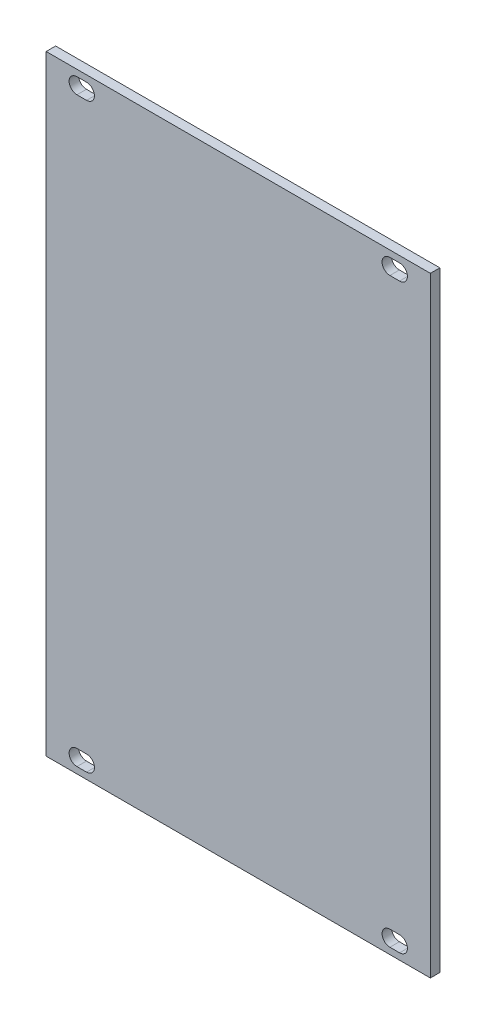
ISO-10303-21;
HEADER;
FILE_DESCRIPTION(('STEP AP214'),'2;1');
FILE_NAME('part.step','',(''),(''),'','','');
FILE_SCHEMA(('AUTOMOTIVE_DESIGN { 1 0 10303 214 1 1 1 1 }'));
ENDSEC;
DATA;
#1=APPLICATION_CONTEXT('core data for automotive mechanical design processes');
#2=APPLICATION_PROTOCOL_DEFINITION('international standard','automotive_design',2000,#1);
#3=PRODUCT_CONTEXT('',#1,'mechanical');
#4=PRODUCT('Part','Part','',(#3));
#5=PRODUCT_RELATED_PRODUCT_CATEGORY('part','',(#4));
#6=PRODUCT_DEFINITION_FORMATION('','',#4);
#7=PRODUCT_DEFINITION_CONTEXT('part definition',#1,'design');
#8=PRODUCT_DEFINITION('design','',#6,#7);
#9=PRODUCT_DEFINITION_SHAPE('','',#8);
#10=(LENGTH_UNIT() NAMED_UNIT(*) SI_UNIT(.MILLI.,.METRE.));
#11=(NAMED_UNIT(*) PLANE_ANGLE_UNIT() SI_UNIT($,.RADIAN.));
#12=(NAMED_UNIT(*) SI_UNIT($,.STERADIAN.) SOLID_ANGLE_UNIT());
#13=UNCERTAINTY_MEASURE_WITH_UNIT(LENGTH_MEASURE(1.E-05),#10,'distance_accuracy_value','');
#14=(GEOMETRIC_REPRESENTATION_CONTEXT(3) GLOBAL_UNCERTAINTY_ASSIGNED_CONTEXT((#13)) GLOBAL_UNIT_ASSIGNED_CONTEXT((#10,
#11,#12)) REPRESENTATION_CONTEXT('',''));
#15=CARTESIAN_POINT('',(0.,0.,0.));
#16=DIRECTION('',(0.,0.,1.));
#17=DIRECTION('',(1.,0.,0.));
#18=AXIS2_PLACEMENT_3D('',#15,#16,#17);
#19=CARTESIAN_POINT('',(0.,0.,2.));
#20=DIRECTION('',(0.,0.,1.));
#21=DIRECTION('',(1.,0.,0.));
#22=AXIS2_PLACEMENT_3D('',#19,#20,#21);
#23=PLANE('',#22);
#24=DIRECTION('',(0.,1.,0.));
#25=VECTOR('',#24,1.);
#26=CARTESIAN_POINT('',(40.45,64.25,2.));
#27=LINE('',#26,#25);
#28=CARTESIAN_POINT('',(40.45,-64.25,2.));
#29=VERTEX_POINT('',#28);
#30=CARTESIAN_POINT('',(40.45,64.25,2.));
#31=VERTEX_POINT('',#30);
#32=EDGE_CURVE('E360',#29,#31,#27,.T.);
#33=ORIENTED_EDGE('',*,*,#32,.T.);
#34=DIRECTION('',(-1.,0.,0.));
#35=VECTOR('',#34,1.);
#36=CARTESIAN_POINT('',(-40.45,64.25,2.));
#37=LINE('',#36,#35);
#38=CARTESIAN_POINT('',(-40.45,64.25,2.));
#39=VERTEX_POINT('',#38);
#40=EDGE_CURVE('E364',#31,#39,#37,.T.);
#41=ORIENTED_EDGE('',*,*,#40,.T.);
#42=DIRECTION('',(0.,-1.,0.));
#43=VECTOR('',#42,1.);
#44=CARTESIAN_POINT('',(-40.45,64.25,2.));
#45=LINE('',#44,#43);
#46=CARTESIAN_POINT('',(-40.45,-64.25,2.));
#47=VERTEX_POINT('',#46);
#48=EDGE_CURVE('E368',#39,#47,#45,.T.);
#49=ORIENTED_EDGE('',*,*,#48,.T.);
#50=DIRECTION('',(1.,0.,0.));
#51=VECTOR('',#50,1.);
#52=CARTESIAN_POINT('',(-40.45,-64.25,2.));
#53=LINE('',#52,#51);
#54=EDGE_CURVE('E371',#47,#29,#53,.T.);
#55=ORIENTED_EDGE('',*,*,#54,.T.);
#56=EDGE_LOOP('',(#33,#41,#49,#55));
#57=FACE_BOUND('',#56,.T.);
#58=DIRECTION('',(1.,0.,0.));
#59=VECTOR('',#58,1.);
#60=CARTESIAN_POINT('',(-33.966,-62.9,2.));
#61=LINE('',#60,#59);
#62=CARTESIAN_POINT('',(-33.966,-62.9,2.));
#63=VERTEX_POINT('',#62);
#64=CARTESIAN_POINT('',(-31.934,-62.9,2.));
#65=VERTEX_POINT('',#64);
#66=EDGE_CURVE('E320',#63,#65,#61,.T.);
#67=ORIENTED_EDGE('',*,*,#66,.F.);
#68=CARTESIAN_POINT('',(-33.966,-61.25,2.));
#69=DIRECTION('',(0.,0.,1.));
#70=DIRECTION('',(1.,0.,0.));
#71=AXIS2_PLACEMENT_3D('',#68,#69,#70);
#72=CIRCLE('',#71,1.65);
#73=CARTESIAN_POINT('',(-33.966,-59.6,2.));
#74=VERTEX_POINT('',#73);
#75=EDGE_CURVE('E317',#74,#63,#72,.T.);
#76=ORIENTED_EDGE('',*,*,#75,.F.);
#77=DIRECTION('',(-1.,0.,0.));
#78=VECTOR('',#77,1.);
#79=CARTESIAN_POINT('',(-33.966,-59.6,2.));
#80=LINE('',#79,#78);
#81=CARTESIAN_POINT('',(-31.934,-59.6,2.));
#82=VERTEX_POINT('',#81);
#83=EDGE_CURVE('E328',#82,#74,#80,.T.);
#84=ORIENTED_EDGE('',*,*,#83,.F.);
#85=CARTESIAN_POINT('',(-31.934,-61.25,2.));
#86=DIRECTION('',(0.,0.,1.));
#87=DIRECTION('',(1.,0.,0.));
#88=AXIS2_PLACEMENT_3D('',#85,#86,#87);
#89=CIRCLE('',#88,1.64999999999999);
#90=EDGE_CURVE('E324',#65,#82,#89,.T.);
#91=ORIENTED_EDGE('',*,*,#90,.F.);
#92=EDGE_LOOP('',(#67,#76,#84,#91));
#93=FACE_BOUND('',#92,.T.);
#94=DIRECTION('',(1.,0.,0.));
#95=VECTOR('',#94,1.);
#96=CARTESIAN_POINT('',(31.934000014,59.6,2.));
#97=LINE('',#96,#95);
#98=CARTESIAN_POINT('',(31.934000014,59.6,2.));
#99=VERTEX_POINT('',#98);
#100=CARTESIAN_POINT('',(33.966000014,59.6,2.));
#101=VERTEX_POINT('',#100);
#102=EDGE_CURVE('E277',#99,#101,#97,.T.);
#103=ORIENTED_EDGE('',*,*,#102,.F.);
#104=CARTESIAN_POINT('',(31.934000014,61.25,2.));
#105=DIRECTION('',(0.,0.,1.));
#106=DIRECTION('',(1.,0.,0.));
#107=AXIS2_PLACEMENT_3D('',#104,#105,#106);
#108=CIRCLE('',#107,1.65);
#109=CARTESIAN_POINT('',(31.934000014,62.9,2.));
#110=VERTEX_POINT('',#109);
#111=EDGE_CURVE('E274',#110,#99,#108,.T.);
#112=ORIENTED_EDGE('',*,*,#111,.F.);
#113=DIRECTION('',(-1.,0.,0.));
#114=VECTOR('',#113,1.);
#115=CARTESIAN_POINT('',(31.934000014,62.9,2.));
#116=LINE('',#115,#114);
#117=CARTESIAN_POINT('',(33.966000014,62.9,2.));
#118=VERTEX_POINT('',#117);
#119=EDGE_CURVE('E285',#118,#110,#116,.T.);
#120=ORIENTED_EDGE('',*,*,#119,.F.);
#121=CARTESIAN_POINT('',(33.966000014,61.25,2.));
#122=DIRECTION('',(0.,0.,1.));
#123=DIRECTION('',(1.,0.,0.));
#124=AXIS2_PLACEMENT_3D('',#121,#122,#123);
#125=CIRCLE('',#124,1.65);
#126=EDGE_CURVE('E281',#101,#118,#125,.T.);
#127=ORIENTED_EDGE('',*,*,#126,.F.);
#128=EDGE_LOOP('',(#103,#112,#120,#127));
#129=FACE_BOUND('',#128,.T.);
#130=DIRECTION('',(1.,0.,0.));
#131=VECTOR('',#130,1.);
#132=CARTESIAN_POINT('',(-33.966,59.6,2.));
#133=LINE('',#132,#131);
#134=CARTESIAN_POINT('',(-33.966,59.6,2.));
#135=VERTEX_POINT('',#134);
#136=CARTESIAN_POINT('',(-31.934,59.6,2.));
#137=VERTEX_POINT('',#136);
#138=EDGE_CURVE('E234',#135,#137,#133,.T.);
#139=ORIENTED_EDGE('',*,*,#138,.F.);
#140=CARTESIAN_POINT('',(-33.966,61.25,2.));
#141=DIRECTION('',(0.,0.,1.));
#142=DIRECTION('',(1.,0.,0.));
#143=AXIS2_PLACEMENT_3D('',#140,#141,#142);
#144=CIRCLE('',#143,1.64999999999998);
#145=CARTESIAN_POINT('',(-33.966,62.9,2.));
#146=VERTEX_POINT('',#145);
#147=EDGE_CURVE('E231',#146,#135,#144,.T.);
#148=ORIENTED_EDGE('',*,*,#147,.F.);
#149=DIRECTION('',(-1.,0.,0.));
#150=VECTOR('',#149,1.);
#151=CARTESIAN_POINT('',(-33.966,62.9,2.));
#152=LINE('',#151,#150);
#153=CARTESIAN_POINT('',(-31.934,62.9,2.));
#154=VERTEX_POINT('',#153);
#155=EDGE_CURVE('E242',#154,#146,#152,.T.);
#156=ORIENTED_EDGE('',*,*,#155,.F.);
#157=CARTESIAN_POINT('',(-31.934,61.25,2.));
#158=DIRECTION('',(0.,0.,1.));
#159=DIRECTION('',(1.,0.,0.));
#160=AXIS2_PLACEMENT_3D('',#157,#158,#159);
#161=CIRCLE('',#160,1.64999999999998);
#162=EDGE_CURVE('E238',#137,#154,#161,.T.);
#163=ORIENTED_EDGE('',*,*,#162,.F.);
#164=EDGE_LOOP('',(#139,#148,#156,#163));
#165=FACE_BOUND('',#164,.T.);
#166=DIRECTION('',(1.,0.,0.));
#167=VECTOR('',#166,1.);
#168=CARTESIAN_POINT('',(31.934000014,-62.9,2.));
#169=LINE('',#168,#167);
#170=CARTESIAN_POINT('',(31.934000014,-62.9,2.));
#171=VERTEX_POINT('',#170);
#172=CARTESIAN_POINT('',(33.966000014,-62.9,2.));
#173=VERTEX_POINT('',#172);
#174=EDGE_CURVE('E192',#171,#173,#169,.T.);
#175=ORIENTED_EDGE('',*,*,#174,.F.);
#176=CARTESIAN_POINT('',(31.934000014,-61.25,2.));
#177=DIRECTION('',(0.,0.,1.));
#178=DIRECTION('',(1.,0.,0.));
#179=AXIS2_PLACEMENT_3D('',#176,#177,#178);
#180=CIRCLE('',#179,1.65);
#181=CARTESIAN_POINT('',(31.934000014,-59.6,2.));
#182=VERTEX_POINT('',#181);
#183=EDGE_CURVE('E183',#182,#171,#180,.T.);
#184=ORIENTED_EDGE('',*,*,#183,.F.);
#185=DIRECTION('',(-1.,0.,0.));
#186=VECTOR('',#185,1.);
#187=CARTESIAN_POINT('',(31.934000014,-59.6,2.));
#188=LINE('',#187,#186);
#189=CARTESIAN_POINT('',(33.966000014,-59.6,2.));
#190=VERTEX_POINT('',#189);
#191=EDGE_CURVE('E209',#190,#182,#188,.T.);
#192=ORIENTED_EDGE('',*,*,#191,.F.);
#193=CARTESIAN_POINT('',(33.966000014,-61.25,2.));
#194=DIRECTION('',(0.,0.,1.));
#195=DIRECTION('',(1.,0.,0.));
#196=AXIS2_PLACEMENT_3D('',#193,#194,#195);
#197=CIRCLE('',#196,1.65);
#198=EDGE_CURVE('E205',#173,#190,#197,.T.);
#199=ORIENTED_EDGE('',*,*,#198,.F.);
#200=EDGE_LOOP('',(#175,#184,#192,#199));
#201=FACE_BOUND('',#200,.T.);
#202=ADVANCED_FACE('F45',(#57,#93,#129,#165,#201),#23,.T.);
#203=CARTESIAN_POINT('',(0.,0.,0.));
#204=DIRECTION('',(0.,0.,1.));
#205=DIRECTION('',(1.,0.,0.));
#206=AXIS2_PLACEMENT_3D('',#203,#204,#205);
#207=PLANE('',#206);
#208=CARTESIAN_POINT('',(-33.966,61.25,0.));
#209=DIRECTION('',(0.,0.,1.));
#210=DIRECTION('',(1.,0.,0.));
#211=AXIS2_PLACEMENT_3D('',#208,#209,#210);
#212=CIRCLE('',#211,1.64999999999998);
#213=CARTESIAN_POINT('',(-33.966,62.9,0.));
#214=VERTEX_POINT('',#213);
#215=CARTESIAN_POINT('',(-33.966,59.6,0.));
#216=VERTEX_POINT('',#215);
#217=EDGE_CURVE('E201',#214,#216,#212,.T.);
#218=ORIENTED_EDGE('',*,*,#217,.T.);
#219=DIRECTION('',(1.,0.,0.));
#220=VECTOR('',#219,1.);
#221=CARTESIAN_POINT('',(-33.966,59.6,0.));
#222=LINE('',#221,#220);
#223=CARTESIAN_POINT('',(-31.934,59.6,0.));
#224=VERTEX_POINT('',#223);
#225=EDGE_CURVE('E249',#216,#224,#222,.T.);
#226=ORIENTED_EDGE('',*,*,#225,.T.);
#227=CARTESIAN_POINT('',(-31.934,61.25,0.));
#228=DIRECTION('',(0.,0.,1.));
#229=DIRECTION('',(1.,0.,0.));
#230=AXIS2_PLACEMENT_3D('',#227,#228,#229);
#231=CIRCLE('',#230,1.64999999999998);
#232=CARTESIAN_POINT('',(-31.934,62.9,0.));
#233=VERTEX_POINT('',#232);
#234=EDGE_CURVE('E253',#224,#233,#231,.T.);
#235=ORIENTED_EDGE('',*,*,#234,.T.);
#236=DIRECTION('',(-1.,0.,0.));
#237=VECTOR('',#236,1.);
#238=CARTESIAN_POINT('',(-33.966,62.9,0.));
#239=LINE('',#238,#237);
#240=EDGE_CURVE('E235',#233,#214,#239,.T.);
#241=ORIENTED_EDGE('',*,*,#240,.T.);
#242=EDGE_LOOP('',(#218,#226,#235,#241));
#243=FACE_BOUND('',#242,.T.);
#244=CARTESIAN_POINT('',(-33.966,-61.25,0.));
#245=DIRECTION('',(0.,0.,1.));
#246=DIRECTION('',(1.,0.,0.));
#247=AXIS2_PLACEMENT_3D('',#244,#245,#246);
#248=CIRCLE('',#247,1.65);
#249=CARTESIAN_POINT('',(-33.966,-59.6,0.));
#250=VERTEX_POINT('',#249);
#251=CARTESIAN_POINT('',(-33.966,-62.9,0.));
#252=VERTEX_POINT('',#251);
#253=EDGE_CURVE('E316',#250,#252,#248,.T.);
#254=ORIENTED_EDGE('',*,*,#253,.T.);
#255=DIRECTION('',(1.,0.,0.));
#256=VECTOR('',#255,1.);
#257=CARTESIAN_POINT('',(-33.966,-62.9,0.));
#258=LINE('',#257,#256);
#259=CARTESIAN_POINT('',(-31.934,-62.9,0.));
#260=VERTEX_POINT('',#259);
#261=EDGE_CURVE('E335',#252,#260,#258,.T.);
#262=ORIENTED_EDGE('',*,*,#261,.T.);
#263=CARTESIAN_POINT('',(-31.934,-61.25,0.));
#264=DIRECTION('',(0.,0.,1.));
#265=DIRECTION('',(1.,0.,0.));
#266=AXIS2_PLACEMENT_3D('',#263,#264,#265);
#267=CIRCLE('',#266,1.64999999999999);
#268=CARTESIAN_POINT('',(-31.934,-59.6,0.));
#269=VERTEX_POINT('',#268);
#270=EDGE_CURVE('E339',#260,#269,#267,.T.);
#271=ORIENTED_EDGE('',*,*,#270,.T.);
#272=DIRECTION('',(-1.,0.,0.));
#273=VECTOR('',#272,1.);
#274=CARTESIAN_POINT('',(-33.966,-59.6,0.));
#275=LINE('',#274,#273);
#276=EDGE_CURVE('E321',#269,#250,#275,.T.);
#277=ORIENTED_EDGE('',*,*,#276,.T.);
#278=EDGE_LOOP('',(#254,#262,#271,#277));
#279=FACE_BOUND('',#278,.T.);
#280=DIRECTION('',(0.,1.,0.));
#281=VECTOR('',#280,1.);
#282=CARTESIAN_POINT('',(40.45,64.25,0.));
#283=LINE('',#282,#281);
#284=CARTESIAN_POINT('',(40.45,-64.25,0.));
#285=VERTEX_POINT('',#284);
#286=CARTESIAN_POINT('',(40.45,64.25,0.));
#287=VERTEX_POINT('',#286);
#288=EDGE_CURVE('E359',#285,#287,#283,.T.);
#289=ORIENTED_EDGE('',*,*,#288,.F.);
#290=DIRECTION('',(1.,0.,0.));
#291=VECTOR('',#290,1.);
#292=CARTESIAN_POINT('',(-40.45,-64.25,0.));
#293=LINE('',#292,#291);
#294=CARTESIAN_POINT('',(-40.45,-64.25,0.));
#295=VERTEX_POINT('',#294);
#296=EDGE_CURVE('E365',#295,#285,#293,.T.);
#297=ORIENTED_EDGE('',*,*,#296,.F.);
#298=DIRECTION('',(0.,-1.,0.));
#299=VECTOR('',#298,1.);
#300=CARTESIAN_POINT('',(-40.45,64.25,0.));
#301=LINE('',#300,#299);
#302=CARTESIAN_POINT('',(-40.45,64.25,0.));
#303=VERTEX_POINT('',#302);
#304=EDGE_CURVE('E381',#303,#295,#301,.T.);
#305=ORIENTED_EDGE('',*,*,#304,.F.);
#306=DIRECTION('',(-1.,0.,0.));
#307=VECTOR('',#306,1.);
#308=CARTESIAN_POINT('',(-40.45,64.25,0.));
#309=LINE('',#308,#307);
#310=EDGE_CURVE('E378',#287,#303,#309,.T.);
#311=ORIENTED_EDGE('',*,*,#310,.F.);
#312=EDGE_LOOP('',(#289,#297,#305,#311));
#313=FACE_BOUND('',#312,.T.);
#314=CARTESIAN_POINT('',(31.934000014,61.25,0.));
#315=DIRECTION('',(0.,0.,1.));
#316=DIRECTION('',(1.,0.,0.));
#317=AXIS2_PLACEMENT_3D('',#314,#315,#316);
#318=CIRCLE('',#317,1.65);
#319=CARTESIAN_POINT('',(31.934000014,62.9,0.));
#320=VERTEX_POINT('',#319);
#321=CARTESIAN_POINT('',(31.934000014,59.6,0.));
#322=VERTEX_POINT('',#321);
#323=EDGE_CURVE('E273',#320,#322,#318,.T.);
#324=ORIENTED_EDGE('',*,*,#323,.T.);
#325=DIRECTION('',(1.,0.,0.));
#326=VECTOR('',#325,1.);
#327=CARTESIAN_POINT('',(31.934000014,59.6,0.));
#328=LINE('',#327,#326);
#329=CARTESIAN_POINT('',(33.966000014,59.6,0.));
#330=VERTEX_POINT('',#329);
#331=EDGE_CURVE('E292',#322,#330,#328,.T.);
#332=ORIENTED_EDGE('',*,*,#331,.T.);
#333=CARTESIAN_POINT('',(33.966000014,61.25,0.));
#334=DIRECTION('',(0.,0.,1.));
#335=DIRECTION('',(1.,0.,0.));
#336=AXIS2_PLACEMENT_3D('',#333,#334,#335);
#337=CIRCLE('',#336,1.65);
#338=CARTESIAN_POINT('',(33.966000014,62.9,0.));
#339=VERTEX_POINT('',#338);
#340=EDGE_CURVE('E296',#330,#339,#337,.T.);
#341=ORIENTED_EDGE('',*,*,#340,.T.);
#342=DIRECTION('',(-1.,0.,0.));
#343=VECTOR('',#342,1.);
#344=CARTESIAN_POINT('',(31.934000014,62.9,0.));
#345=LINE('',#344,#343);
#346=EDGE_CURVE('E278',#339,#320,#345,.T.);
#347=ORIENTED_EDGE('',*,*,#346,.T.);
#348=EDGE_LOOP('',(#324,#332,#341,#347));
#349=FACE_BOUND('',#348,.T.);
#350=CARTESIAN_POINT('',(31.934000014,-61.25,0.));
#351=DIRECTION('',(0.,0.,1.));
#352=DIRECTION('',(1.,0.,0.));
#353=AXIS2_PLACEMENT_3D('',#350,#351,#352);
#354=CIRCLE('',#353,1.65);
#355=CARTESIAN_POINT('',(31.934000014,-59.6,0.));
#356=VERTEX_POINT('',#355);
#357=CARTESIAN_POINT('',(31.934000014,-62.9,0.));
#358=VERTEX_POINT('',#357);
#359=EDGE_CURVE('E69',#356,#358,#354,.T.);
#360=ORIENTED_EDGE('',*,*,#359,.T.);
#361=DIRECTION('',(1.,0.,0.));
#362=VECTOR('',#361,1.);
#363=CARTESIAN_POINT('',(31.934000014,-62.9,0.));
#364=LINE('',#363,#362);
#365=CARTESIAN_POINT('',(33.966000014,-62.9,0.));
#366=VERTEX_POINT('',#365);
#367=EDGE_CURVE('E199',#358,#366,#364,.T.);
#368=ORIENTED_EDGE('',*,*,#367,.T.);
#369=CARTESIAN_POINT('',(33.966000014,-61.25,0.));
#370=DIRECTION('',(0.,0.,1.));
#371=DIRECTION('',(1.,0.,0.));
#372=AXIS2_PLACEMENT_3D('',#369,#370,#371);
#373=CIRCLE('',#372,1.65);
#374=CARTESIAN_POINT('',(33.966000014,-59.6,0.));
#375=VERTEX_POINT('',#374);
#376=EDGE_CURVE('E218',#366,#375,#373,.T.);
#377=ORIENTED_EDGE('',*,*,#376,.T.);
#378=DIRECTION('',(-1.,0.,0.));
#379=VECTOR('',#378,1.);
#380=CARTESIAN_POINT('',(31.934000014,-59.6,0.));
#381=LINE('',#380,#379);
#382=EDGE_CURVE('E193',#375,#356,#381,.T.);
#383=ORIENTED_EDGE('',*,*,#382,.T.);
#384=EDGE_LOOP('',(#360,#368,#377,#383));
#385=FACE_BOUND('',#384,.T.);
#386=ADVANCED_FACE('F404',(#243,#279,#313,#349,#385),#207,.F.);
#387=CARTESIAN_POINT('',(40.45,64.25,2.));
#388=DIRECTION('',(-1.,0.,0.));
#389=DIRECTION('',(0.,-1.,0.));
#390=AXIS2_PLACEMENT_3D('',#387,#388,#389);
#391=PLANE('',#390);
#392=ORIENTED_EDGE('',*,*,#288,.T.);
#393=DIRECTION('',(0.,0.,-1.));
#394=VECTOR('',#393,1.);
#395=CARTESIAN_POINT('',(40.45,64.25,2.));
#396=LINE('',#395,#394);
#397=EDGE_CURVE('E11',#31,#287,#396,.T.);
#398=ORIENTED_EDGE('',*,*,#397,.F.);
#399=ORIENTED_EDGE('',*,*,#32,.F.);
#400=DIRECTION('',(0.,0.,-1.));
#401=VECTOR('',#400,1.);
#402=CARTESIAN_POINT('',(40.45,-64.25,2.));
#403=LINE('',#402,#401);
#404=EDGE_CURVE('E374',#29,#285,#403,.T.);
#405=ORIENTED_EDGE('',*,*,#404,.T.);
#406=EDGE_LOOP('',(#392,#398,#399,#405));
#407=FACE_BOUND('',#406,.T.);
#408=ADVANCED_FACE('F47',(#407),#391,.F.);
#409=CARTESIAN_POINT('',(-40.45,64.25,2.));
#410=DIRECTION('',(0.,-1.,0.));
#411=DIRECTION('',(0.,0.,-1.));
#412=AXIS2_PLACEMENT_3D('',#409,#410,#411);
#413=PLANE('',#412);
#414=ORIENTED_EDGE('',*,*,#310,.T.);
#415=DIRECTION('',(0.,0.,-1.));
#416=VECTOR('',#415,1.);
#417=CARTESIAN_POINT('',(-40.45,64.25,2.));
#418=LINE('',#417,#416);
#419=EDGE_CURVE('E54',#39,#303,#418,.T.);
#420=ORIENTED_EDGE('',*,*,#419,.F.);
#421=ORIENTED_EDGE('',*,*,#40,.F.);
#422=ORIENTED_EDGE('',*,*,#397,.T.);
#423=EDGE_LOOP('',(#414,#420,#421,#422));
#424=FACE_BOUND('',#423,.T.);
#425=ADVANCED_FACE('F415',(#424),#413,.F.);
#426=CARTESIAN_POINT('',(-40.45,64.25,2.));
#427=DIRECTION('',(1.,0.,0.));
#428=DIRECTION('',(0.,1.,0.));
#429=AXIS2_PLACEMENT_3D('',#426,#427,#428);
#430=PLANE('',#429);
#431=ORIENTED_EDGE('',*,*,#304,.T.);
#432=DIRECTION('',(0.,0.,-1.));
#433=VECTOR('',#432,1.);
#434=CARTESIAN_POINT('',(-40.45,-64.25,2.));
#435=LINE('',#434,#433);
#436=EDGE_CURVE('E389',#47,#295,#435,.T.);
#437=ORIENTED_EDGE('',*,*,#436,.F.);
#438=ORIENTED_EDGE('',*,*,#48,.F.);
#439=ORIENTED_EDGE('',*,*,#419,.T.);
#440=EDGE_LOOP('',(#431,#437,#438,#439));
#441=FACE_BOUND('',#440,.T.);
#442=ADVANCED_FACE('F398',(#441),#430,.F.);
#443=CARTESIAN_POINT('',(-40.45,-64.25,2.));
#444=DIRECTION('',(0.,1.,0.));
#445=DIRECTION('',(0.,0.,1.));
#446=AXIS2_PLACEMENT_3D('',#443,#444,#445);
#447=PLANE('',#446);
#448=ORIENTED_EDGE('',*,*,#296,.T.);
#449=ORIENTED_EDGE('',*,*,#404,.F.);
#450=ORIENTED_EDGE('',*,*,#54,.F.);
#451=ORIENTED_EDGE('',*,*,#436,.T.);
#452=EDGE_LOOP('',(#448,#449,#450,#451));
#453=FACE_BOUND('',#452,.T.);
#454=ADVANCED_FACE('F408',(#453),#447,.F.);
#455=CARTESIAN_POINT('',(-33.966,-61.25,2.));
#456=DIRECTION('',(0.,0.,-1.));
#457=DIRECTION('',(-1.,0.,0.));
#458=AXIS2_PLACEMENT_3D('',#455,#456,#457);
#459=CYLINDRICAL_SURFACE('',#458,1.65);
#460=ORIENTED_EDGE('',*,*,#253,.F.);
#461=DIRECTION('',(0.,0.,-1.));
#462=VECTOR('',#461,1.);
#463=CARTESIAN_POINT('',(-33.966,-59.6,2.));
#464=LINE('',#463,#462);
#465=EDGE_CURVE('E331',#74,#250,#464,.T.);
#466=ORIENTED_EDGE('',*,*,#465,.F.);
#467=ORIENTED_EDGE('',*,*,#75,.T.);
#468=DIRECTION('',(0.,0.,-1.));
#469=VECTOR('',#468,1.);
#470=CARTESIAN_POINT('',(-33.966,-62.9,2.));
#471=LINE('',#470,#469);
#472=EDGE_CURVE('E355',#63,#252,#471,.T.);
#473=ORIENTED_EDGE('',*,*,#472,.T.);
#474=EDGE_LOOP('',(#460,#466,#467,#473));
#475=FACE_BOUND('',#474,.T.);
#476=ADVANCED_FACE('F430',(#475),#459,.F.);
#477=CARTESIAN_POINT('',(-33.966,-62.9,2.));
#478=DIRECTION('',(0.,1.,0.));
#479=DIRECTION('',(-1.,0.,0.));
#480=AXIS2_PLACEMENT_3D('',#477,#478,#479);
#481=PLANE('',#480);
#482=ORIENTED_EDGE('',*,*,#261,.F.);
#483=ORIENTED_EDGE('',*,*,#472,.F.);
#484=ORIENTED_EDGE('',*,*,#66,.T.);
#485=DIRECTION('',(0.,0.,-1.));
#486=VECTOR('',#485,1.);
#487=CARTESIAN_POINT('',(-31.934,-62.9,2.));
#488=LINE('',#487,#486);
#489=EDGE_CURVE('E352',#65,#260,#488,.T.);
#490=ORIENTED_EDGE('',*,*,#489,.T.);
#491=EDGE_LOOP('',(#482,#483,#484,#490));
#492=FACE_BOUND('',#491,.T.);
#493=ADVANCED_FACE('F437',(#492),#481,.T.);
#494=CARTESIAN_POINT('',(-31.934,-61.25,2.));
#495=DIRECTION('',(0.,0.,-1.));
#496=DIRECTION('',(-1.,0.,0.));
#497=AXIS2_PLACEMENT_3D('',#494,#495,#496);
#498=CYLINDRICAL_SURFACE('',#497,1.64999999999999);
#499=ORIENTED_EDGE('',*,*,#270,.F.);
#500=ORIENTED_EDGE('',*,*,#489,.F.);
#501=ORIENTED_EDGE('',*,*,#90,.T.);
#502=DIRECTION('',(0.,0.,-1.));
#503=VECTOR('',#502,1.);
#504=CARTESIAN_POINT('',(-31.934,-59.6,2.));
#505=LINE('',#504,#503);
#506=EDGE_CURVE('E349',#82,#269,#505,.T.);
#507=ORIENTED_EDGE('',*,*,#506,.T.);
#508=EDGE_LOOP('',(#499,#500,#501,#507));
#509=FACE_BOUND('',#508,.T.);
#510=ADVANCED_FACE('F442',(#509),#498,.F.);
#511=CARTESIAN_POINT('',(-33.966,-59.6,2.));
#512=DIRECTION('',(0.,-1.,0.));
#513=DIRECTION('',(0.,0.,-1.));
#514=AXIS2_PLACEMENT_3D('',#511,#512,#513);
#515=PLANE('',#514);
#516=ORIENTED_EDGE('',*,*,#276,.F.);
#517=ORIENTED_EDGE('',*,*,#506,.F.);
#518=ORIENTED_EDGE('',*,*,#83,.T.);
#519=ORIENTED_EDGE('',*,*,#465,.T.);
#520=EDGE_LOOP('',(#516,#517,#518,#519));
#521=FACE_BOUND('',#520,.T.);
#522=ADVANCED_FACE('F450',(#521),#515,.T.);
#523=CARTESIAN_POINT('',(31.934000014,61.25,2.));
#524=DIRECTION('',(0.,0.,-1.));
#525=DIRECTION('',(-1.,0.,0.));
#526=AXIS2_PLACEMENT_3D('',#523,#524,#525);
#527=CYLINDRICAL_SURFACE('',#526,1.65);
#528=ORIENTED_EDGE('',*,*,#323,.F.);
#529=DIRECTION('',(0.,0.,-1.));
#530=VECTOR('',#529,1.);
#531=CARTESIAN_POINT('',(31.934000014,62.9,2.));
#532=LINE('',#531,#530);
#533=EDGE_CURVE('E288',#110,#320,#532,.T.);
#534=ORIENTED_EDGE('',*,*,#533,.F.);
#535=ORIENTED_EDGE('',*,*,#111,.T.);
#536=DIRECTION('',(0.,0.,-1.));
#537=VECTOR('',#536,1.);
#538=CARTESIAN_POINT('',(31.934000014,59.6,2.));
#539=LINE('',#538,#537);
#540=EDGE_CURVE('E312',#99,#322,#539,.T.);
#541=ORIENTED_EDGE('',*,*,#540,.T.);
#542=EDGE_LOOP('',(#528,#534,#535,#541));
#543=FACE_BOUND('',#542,.T.);
#544=ADVANCED_FACE('F504',(#543),#527,.F.);
#545=CARTESIAN_POINT('',(31.934000014,59.6,2.));
#546=DIRECTION('',(0.,1.,0.));
#547=DIRECTION('',(0.,0.,1.));
#548=AXIS2_PLACEMENT_3D('',#545,#546,#547);
#549=PLANE('',#548);
#550=ORIENTED_EDGE('',*,*,#331,.F.);
#551=ORIENTED_EDGE('',*,*,#540,.F.);
#552=ORIENTED_EDGE('',*,*,#102,.T.);
#553=DIRECTION('',(0.,0.,-1.));
#554=VECTOR('',#553,1.);
#555=CARTESIAN_POINT('',(33.966000014,59.6,2.));
#556=LINE('',#555,#554);
#557=EDGE_CURVE('E309',#101,#330,#556,.T.);
#558=ORIENTED_EDGE('',*,*,#557,.T.);
#559=EDGE_LOOP('',(#550,#551,#552,#558));
#560=FACE_BOUND('',#559,.T.);
#561=ADVANCED_FACE('F500',(#560),#549,.T.);
#562=CARTESIAN_POINT('',(33.966000014,61.25,2.));
#563=DIRECTION('',(0.,0.,-1.));
#564=DIRECTION('',(-1.,0.,0.));
#565=AXIS2_PLACEMENT_3D('',#562,#563,#564);
#566=CYLINDRICAL_SURFACE('',#565,1.65);
#567=ORIENTED_EDGE('',*,*,#340,.F.);
#568=ORIENTED_EDGE('',*,*,#557,.F.);
#569=ORIENTED_EDGE('',*,*,#126,.T.);
#570=DIRECTION('',(0.,0.,-1.));
#571=VECTOR('',#570,1.);
#572=CARTESIAN_POINT('',(33.966000014,62.9,2.));
#573=LINE('',#572,#571);
#574=EDGE_CURVE('E306',#118,#339,#573,.T.);
#575=ORIENTED_EDGE('',*,*,#574,.T.);
#576=EDGE_LOOP('',(#567,#568,#569,#575));
#577=FACE_BOUND('',#576,.T.);
#578=ADVANCED_FACE('F496',(#577),#566,.F.);
#579=CARTESIAN_POINT('',(31.934000014,62.9,2.));
#580=DIRECTION('',(0.,-1.,0.));
#581=DIRECTION('',(0.,0.,-1.));
#582=AXIS2_PLACEMENT_3D('',#579,#580,#581);
#583=PLANE('',#582);
#584=ORIENTED_EDGE('',*,*,#346,.F.);
#585=ORIENTED_EDGE('',*,*,#574,.F.);
#586=ORIENTED_EDGE('',*,*,#119,.T.);
#587=ORIENTED_EDGE('',*,*,#533,.T.);
#588=EDGE_LOOP('',(#584,#585,#586,#587));
#589=FACE_BOUND('',#588,.T.);
#590=ADVANCED_FACE('F493',(#589),#583,.T.);
#591=CARTESIAN_POINT('',(-33.966,61.25,2.));
#592=DIRECTION('',(0.,0.,-1.));
#593=DIRECTION('',(-1.,0.,0.));
#594=AXIS2_PLACEMENT_3D('',#591,#592,#593);
#595=CYLINDRICAL_SURFACE('',#594,1.64999999999998);
#596=ORIENTED_EDGE('',*,*,#217,.F.);
#597=DIRECTION('',(0.,0.,-1.));
#598=VECTOR('',#597,1.);
#599=CARTESIAN_POINT('',(-33.966,62.9,2.));
#600=LINE('',#599,#598);
#601=EDGE_CURVE('E245',#146,#214,#600,.T.);
#602=ORIENTED_EDGE('',*,*,#601,.F.);
#603=ORIENTED_EDGE('',*,*,#147,.T.);
#604=DIRECTION('',(0.,0.,-1.));
#605=VECTOR('',#604,1.);
#606=CARTESIAN_POINT('',(-33.966,59.6,2.));
#607=LINE('',#606,#605);
#608=EDGE_CURVE('E269',#135,#216,#607,.T.);
#609=ORIENTED_EDGE('',*,*,#608,.T.);
#610=EDGE_LOOP('',(#596,#602,#603,#609));
#611=FACE_BOUND('',#610,.T.);
#612=ADVANCED_FACE('F475',(#611),#595,.F.);
#613=CARTESIAN_POINT('',(-33.966,59.6,2.));
#614=DIRECTION('',(0.,1.,0.));
#615=DIRECTION('',(0.,0.,1.));
#616=AXIS2_PLACEMENT_3D('',#613,#614,#615);
#617=PLANE('',#616);
#618=ORIENTED_EDGE('',*,*,#225,.F.);
#619=ORIENTED_EDGE('',*,*,#608,.F.);
#620=ORIENTED_EDGE('',*,*,#138,.T.);
#621=DIRECTION('',(0.,0.,-1.));
#622=VECTOR('',#621,1.);
#623=CARTESIAN_POINT('',(-31.934,59.6,2.));
#624=LINE('',#623,#622);
#625=EDGE_CURVE('E266',#137,#224,#624,.T.);
#626=ORIENTED_EDGE('',*,*,#625,.T.);
#627=EDGE_LOOP('',(#618,#619,#620,#626));
#628=FACE_BOUND('',#627,.T.);
#629=ADVANCED_FACE('F469',(#628),#617,.T.);
#630=CARTESIAN_POINT('',(-31.934,61.25,2.));
#631=DIRECTION('',(0.,0.,-1.));
#632=DIRECTION('',(-1.,0.,0.));
#633=AXIS2_PLACEMENT_3D('',#630,#631,#632);
#634=CYLINDRICAL_SURFACE('',#633,1.64999999999998);
#635=ORIENTED_EDGE('',*,*,#234,.F.);
#636=ORIENTED_EDGE('',*,*,#625,.F.);
#637=ORIENTED_EDGE('',*,*,#162,.T.);
#638=DIRECTION('',(0.,0.,-1.));
#639=VECTOR('',#638,1.);
#640=CARTESIAN_POINT('',(-31.934,62.9,2.));
#641=LINE('',#640,#639);
#642=EDGE_CURVE('E263',#154,#233,#641,.T.);
#643=ORIENTED_EDGE('',*,*,#642,.T.);
#644=EDGE_LOOP('',(#635,#636,#637,#643));
#645=FACE_BOUND('',#644,.T.);
#646=ADVANCED_FACE('F472',(#645),#634,.F.);
#647=CARTESIAN_POINT('',(-33.966,62.9,2.));
#648=DIRECTION('',(0.,-1.,0.));
#649=DIRECTION('',(0.,0.,-1.));
#650=AXIS2_PLACEMENT_3D('',#647,#648,#649);
#651=PLANE('',#650);
#652=ORIENTED_EDGE('',*,*,#240,.F.);
#653=ORIENTED_EDGE('',*,*,#642,.F.);
#654=ORIENTED_EDGE('',*,*,#155,.T.);
#655=ORIENTED_EDGE('',*,*,#601,.T.);
#656=EDGE_LOOP('',(#652,#653,#654,#655));
#657=FACE_BOUND('',#656,.T.);
#658=ADVANCED_FACE('F478',(#657),#651,.T.);
#659=CARTESIAN_POINT('',(31.934000014,-61.25,2.));
#660=DIRECTION('',(0.,0.,-1.));
#661=DIRECTION('',(-1.,0.,0.));
#662=AXIS2_PLACEMENT_3D('',#659,#660,#661);
#663=CYLINDRICAL_SURFACE('',#662,1.65);
#664=ORIENTED_EDGE('',*,*,#359,.F.);
#665=DIRECTION('',(0.,0.,-1.));
#666=VECTOR('',#665,1.);
#667=CARTESIAN_POINT('',(31.934000014,-59.6,2.));
#668=LINE('',#667,#666);
#669=EDGE_CURVE('E187',#182,#356,#668,.T.);
#670=ORIENTED_EDGE('',*,*,#669,.F.);
#671=ORIENTED_EDGE('',*,*,#183,.T.);
#672=DIRECTION('',(0.,0.,-1.));
#673=VECTOR('',#672,1.);
#674=CARTESIAN_POINT('',(31.934000014,-62.9,2.));
#675=LINE('',#674,#673);
#676=EDGE_CURVE('E186',#171,#358,#675,.T.);
#677=ORIENTED_EDGE('',*,*,#676,.T.);
#678=EDGE_LOOP('',(#664,#670,#671,#677));
#679=FACE_BOUND('',#678,.T.);
#680=ADVANCED_FACE('F185',(#679),#663,.F.);
#681=CARTESIAN_POINT('',(31.934000014,-62.9,2.));
#682=DIRECTION('',(0.,1.,0.));
#683=DIRECTION('',(0.,0.,1.));
#684=AXIS2_PLACEMENT_3D('',#681,#682,#683);
#685=PLANE('',#684);
#686=ORIENTED_EDGE('',*,*,#367,.F.);
#687=ORIENTED_EDGE('',*,*,#676,.F.);
#688=ORIENTED_EDGE('',*,*,#174,.T.);
#689=DIRECTION('',(0.,0.,-1.));
#690=VECTOR('',#689,1.);
#691=CARTESIAN_POINT('',(33.966000014,-62.9,2.));
#692=LINE('',#691,#690);
#693=EDGE_CURVE('E202',#173,#366,#692,.T.);
#694=ORIENTED_EDGE('',*,*,#693,.T.);
#695=EDGE_LOOP('',(#686,#687,#688,#694));
#696=FACE_BOUND('',#695,.T.);
#697=ADVANCED_FACE('F196',(#696),#685,.T.);
#698=CARTESIAN_POINT('',(33.966000014,-61.25,2.));
#699=DIRECTION('',(0.,0.,-1.));
#700=DIRECTION('',(-1.,0.,0.));
#701=AXIS2_PLACEMENT_3D('',#698,#699,#700);
#702=CYLINDRICAL_SURFACE('',#701,1.65);
#703=ORIENTED_EDGE('',*,*,#376,.F.);
#704=ORIENTED_EDGE('',*,*,#693,.F.);
#705=ORIENTED_EDGE('',*,*,#198,.T.);
#706=DIRECTION('',(0.,0.,-1.));
#707=VECTOR('',#706,1.);
#708=CARTESIAN_POINT('',(33.966000014,-59.6,2.));
#709=LINE('',#708,#707);
#710=EDGE_CURVE('E61',#190,#375,#709,.T.);
#711=ORIENTED_EDGE('',*,*,#710,.T.);
#712=EDGE_LOOP('',(#703,#704,#705,#711));
#713=FACE_BOUND('',#712,.T.);
#714=ADVANCED_FACE('F576',(#713),#702,.F.);
#715=CARTESIAN_POINT('',(31.934000014,-59.6,2.));
#716=DIRECTION('',(0.,-1.,0.));
#717=DIRECTION('',(0.,0.,-1.));
#718=AXIS2_PLACEMENT_3D('',#715,#716,#717);
#719=PLANE('',#718);
#720=ORIENTED_EDGE('',*,*,#382,.F.);
#721=ORIENTED_EDGE('',*,*,#710,.F.);
#722=ORIENTED_EDGE('',*,*,#191,.T.);
#723=ORIENTED_EDGE('',*,*,#669,.T.);
#724=EDGE_LOOP('',(#720,#721,#722,#723));
#725=FACE_BOUND('',#724,.T.);
#726=ADVANCED_FACE('F584',(#725),#719,.T.);
#727=CLOSED_SHELL('',(#202,#386,#408,#425,#442,#454,#476,#493,#510,#522,#544,#561,#578,#590,
#612,#629,#646,#658,#680,#697,#714,#726));
#728=MANIFOLD_SOLID_BREP('B2',#727);
#729=ADVANCED_BREP_SHAPE_REPRESENTATION('',(#18,#728),#14);
#730=SHAPE_DEFINITION_REPRESENTATION(#9,#729);
ENDSEC;
END-ISO-10303-21;
